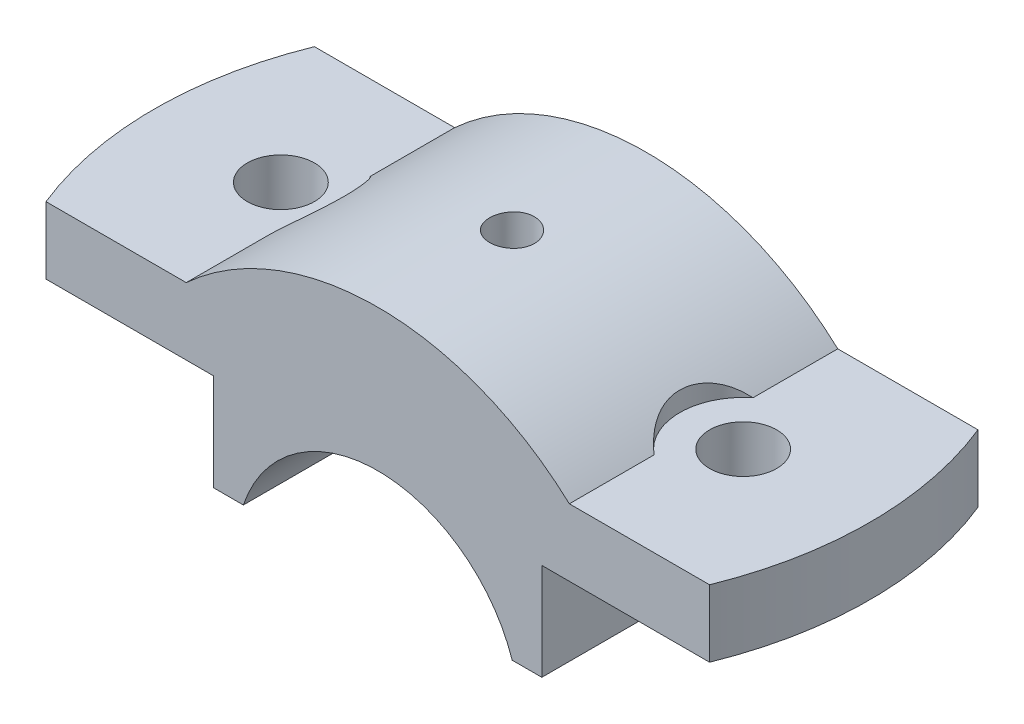
ISO-10303-21;
HEADER;
FILE_DESCRIPTION(('STEP AP214'),'2;1');
FILE_NAME('part.step','',(''),(''),'','','');
FILE_SCHEMA(('AUTOMOTIVE_DESIGN { 1 0 10303 214 1 1 1 1 }'));
ENDSEC;
DATA;
#1=APPLICATION_CONTEXT('core data for automotive mechanical design processes');
#2=APPLICATION_PROTOCOL_DEFINITION('international standard','automotive_design',2000,#1);
#3=PRODUCT_CONTEXT('',#1,'mechanical');
#4=PRODUCT('Part','Part','',(#3));
#5=PRODUCT_RELATED_PRODUCT_CATEGORY('part','',(#4));
#6=PRODUCT_DEFINITION_FORMATION('','',#4);
#7=PRODUCT_DEFINITION_CONTEXT('part definition',#1,'design');
#8=PRODUCT_DEFINITION('design','',#6,#7);
#9=PRODUCT_DEFINITION_SHAPE('','',#8);
#10=(LENGTH_UNIT() NAMED_UNIT(*) SI_UNIT(.MILLI.,.METRE.));
#11=(NAMED_UNIT(*) PLANE_ANGLE_UNIT() SI_UNIT($,.RADIAN.));
#12=(NAMED_UNIT(*) SI_UNIT($,.STERADIAN.) SOLID_ANGLE_UNIT());
#13=UNCERTAINTY_MEASURE_WITH_UNIT(LENGTH_MEASURE(1.E-05),#10,'distance_accuracy_value','');
#14=(GEOMETRIC_REPRESENTATION_CONTEXT(3) GLOBAL_UNCERTAINTY_ASSIGNED_CONTEXT((#13)) GLOBAL_UNIT_ASSIGNED_CONTEXT((#10,
#11,#12)) REPRESENTATION_CONTEXT('',''));
#15=CARTESIAN_POINT('',(0.,0.,0.));
#16=DIRECTION('',(0.,0.,1.));
#17=DIRECTION('',(1.,0.,0.));
#18=AXIS2_PLACEMENT_3D('',#15,#16,#17);
#19=CARTESIAN_POINT('',(0.,0.,18.));
#20=DIRECTION('',(0.,0.,-1.));
#21=DIRECTION('',(-1.,0.,0.));
#22=AXIS2_PLACEMENT_3D('',#19,#20,#21);
#23=CYLINDRICAL_SURFACE('',#22,38.);
#24=CARTESIAN_POINT('',(0.,38.,2.99999999999999));
#25=CARTESIAN_POINT('',(-0.168230277437706,37.9999984430739,2.99999263868346));
#26=CARTESIAN_POINT('',(-0.336575845655095,37.9988709200709,2.98580169916932));
#27=CARTESIAN_POINT('',(-0.668611397196742,37.9944814128081,2.92939894930333));
#28=CARTESIAN_POINT('',(-0.832295850092009,37.9912169949172,2.88715518982943));
#29=CARTESIAN_POINT('',(-1.15015205512757,37.9829226863334,2.77587406357067));
#30=CARTESIAN_POINT('',(-1.3043290493551,37.9778937789402,2.70685161752221));
#31=CARTESIAN_POINT('',(-1.59887136159142,37.9666348413683,2.54399853963546));
#32=CARTESIAN_POINT('',(-1.73923967362019,37.9604050724332,2.45017330191646));
#33=CARTESIAN_POINT('',(-2.00254103126273,37.9474277075509,2.24014409327318));
#34=CARTESIAN_POINT('',(-2.12543792166292,37.9406790810774,2.1238948563935));
#35=CARTESIAN_POINT('',(-2.34999780988339,37.9274332919605,1.87241281605956));
#36=CARTESIAN_POINT('',(-2.45165988585507,37.9209361402441,1.73717918887838));
#37=CARTESIAN_POINT('',(-2.63098484586302,37.9089176287414,1.45135065682847));
#38=CARTESIAN_POINT('',(-2.708616254697,37.903397552738,1.30073594623714));
#39=CARTESIAN_POINT('',(-2.83747510230931,37.8939696224708,0.988558849059875));
#40=CARTESIAN_POINT('',(-2.88870296451239,37.8900617423529,0.82699663808231));
#41=CARTESIAN_POINT('',(-2.96319644645853,37.8843090780475,0.497870679819641));
#42=CARTESIAN_POINT('',(-2.98652059882487,37.8824599758018,0.33032025735777));
#43=CARTESIAN_POINT('',(-3.00472536931325,37.8810204867557,-0.00632681714998046));
#44=CARTESIAN_POINT('',(-2.99960647157769,37.8814300615093,-0.175423442828303));
#45=CARTESIAN_POINT('',(-2.96111886260011,37.8844577346025,-0.509962310035282));
#46=CARTESIAN_POINT('',(-2.92781369865023,37.8870708648728,-0.675411913710737));
#47=CARTESIAN_POINT('',(-2.83399765916122,37.8942034046858,-0.998365215123264));
#48=CARTESIAN_POINT('',(-2.77348654183749,37.8987228311701,-1.15586884222906));
#49=CARTESIAN_POINT('',(-2.62690490032727,37.9091644380148,-1.45866214971911));
#50=CARTESIAN_POINT('',(-2.54080579129679,37.9150881856644,-1.60393793599879));
#51=CARTESIAN_POINT('',(-2.34551283184452,37.9276694800349,-1.87799978791044));
#52=CARTESIAN_POINT('',(-2.23631856235736,37.9343270400699,-2.0067855542603));
#53=CARTESIAN_POINT('',(-1.99757813910437,37.947647885739,-2.24458115896057));
#54=CARTESIAN_POINT('',(-1.86797703439473,37.9543111370687,-2.35353583758633));
#55=CARTESIAN_POINT('',(-1.59229376436976,37.9668751419437,-2.54815019879117));
#56=CARTESIAN_POINT('',(-1.44621158946688,37.9727758950454,-2.63380986781872));
#57=CARTESIAN_POINT('',(-1.14167761997913,37.983150993084,-2.77939892547026));
#58=CARTESIAN_POINT('',(-0.983224692335488,37.9876252071703,-2.83932595392175));
#59=CARTESIAN_POINT('',(-0.658463212690177,37.9946415451888,-2.93171041942903));
#60=CARTESIAN_POINT('',(-0.492154807064346,37.997183705107,-2.96416836811962));
#61=CARTESIAN_POINT('',(-0.156881478742684,38.0000448768352,-3.00062434440681));
#62=CARTESIAN_POINT('',(0.0120751089608382,38.0003698415183,-3.00469857910482));
#63=CARTESIAN_POINT('',(0.348269003373999,37.9987758913175,-2.98447098943402));
#64=CARTESIAN_POINT('',(0.515506324442483,37.9968569951891,-2.96016940224688));
#65=CARTESIAN_POINT('',(0.843297753735754,37.9909950041868,-2.88394314979588));
#66=CARTESIAN_POINT('',(1.00386010671882,37.987054491835,-2.83205372367032));
#67=CARTESIAN_POINT('',(1.31399900365978,37.9775920824189,-2.70216068710782));
#68=CARTESIAN_POINT('',(1.46357539119334,37.9720701628431,-2.62415670492505));
#69=CARTESIAN_POINT('',(1.74784375041781,37.9600494395666,-2.44405671040129));
#70=CARTESIAN_POINT('',(1.88250358772923,37.953548595394,-2.34191011569745));
#71=CARTESIAN_POINT('',(2.13279217984117,37.9403075453845,-2.11649766051109));
#72=CARTESIAN_POINT('',(2.24842063776818,37.9335673358158,-1.99323147064187));
#73=CARTESIAN_POINT('',(2.4576248497514,37.9205896766453,-1.72874864835165));
#74=CARTESIAN_POINT('',(2.55115094155127,37.9143533795852,-1.58749266904679));
#75=CARTESIAN_POINT('',(2.713155238272,37.9031055627809,-1.29123629441747));
#76=CARTESIAN_POINT('',(2.78163367119924,37.8980940318878,-1.13623602422189));
#77=CARTESIAN_POINT('',(2.89151387110069,37.8898693720601,-0.817068099787168));
#78=CARTESIAN_POINT('',(2.93294623887224,37.8866542112497,-0.652911034998946));
#79=CARTESIAN_POINT('',(2.98765790023766,37.8823793491511,-0.319943850373173));
#80=CARTESIAN_POINT('',(3.00093767292138,37.8813196111828,-0.151133809767669));
#81=CARTESIAN_POINT('',(2.99896188688675,37.8814760426207,0.185853858942923));
#82=CARTESIAN_POINT('',(2.98378436644711,37.8826859878913,0.354031953001599));
#83=CARTESIAN_POINT('',(2.92548733876923,37.887232237977,0.68544287301911));
#84=CARTESIAN_POINT('',(2.8823677867555,37.8905685461995,0.848675691052988));
#85=CARTESIAN_POINT('',(2.7694300101543,37.8989899804525,1.16556899687011));
#86=CARTESIAN_POINT('',(2.69961296444521,37.9040750292632,1.31922990697071));
#87=CARTESIAN_POINT('',(2.535271096382,37.9154210711218,1.61266178094886));
#88=CARTESIAN_POINT('',(2.44074672054794,37.9216820429175,1.75243299578316));
#89=CARTESIAN_POINT('',(2.22938062382269,37.9346948182221,2.01451680288399));
#90=CARTESIAN_POINT('',(2.11248130954251,37.941447859921,2.13678288515432));
#91=CARTESIAN_POINT('',(1.85978424897896,37.954672635902,2.36000556130416));
#92=CARTESIAN_POINT('',(1.72398192526551,37.9611443015481,2.46095697881558));
#93=CARTESIAN_POINT('',(1.43709756450133,37.9730876131211,2.63880542567551));
#94=CARTESIAN_POINT('',(1.2859897583193,37.978557527474,2.71566096437293));
#95=CARTESIAN_POINT('',(0.973076064569826,37.9878601967286,2.8428120018995));
#96=CARTESIAN_POINT('',(0.811282773093927,37.9916948408735,2.89313816633252));
#97=CARTESIAN_POINT('',(0.540438770546244,37.9963056825779,2.95292296572033));
#98=CARTESIAN_POINT('',(0.433132098217289,37.9976847801056,2.97055353917027));
#99=CARTESIAN_POINT('',(0.217232975456251,37.9995324404705,2.99409441950641));
#100=CARTESIAN_POINT('',(0.108640528034263,38.0000010054389,3.0000047538251));
#101=CARTESIAN_POINT('',(0.,38.,2.99999999999999));
#102=B_SPLINE_CURVE_WITH_KNOTS('',3,(#24,#25,#26,#27,#28,#29,#30,#31,#32,#33,#34,#35,#36,#37,
#38,#39,#40,#41,#42,#43,#44,#45,#46,#47,#48,#49,#50,#51,#52,#53,#54,#55,#56,#57,#58,#59,#60,#61,
#62,#63,#64,#65,#66,#67,#68,#69,#70,#71,#72,#73,#74,#75,#76,#77,#78,#79,#80,#81,#82,#83,#84,#85,
#86,#87,#88,#89,#90,#91,#92,#93,#94,#95,#96,#97,#98,#99,#100,#101),.UNSPECIFIED.,.T.,.F.,(4,2,2,
2,2,2,2,2,2,2,2,2,2,2,2,2,2,2,2,2,2,2,2,2,2,2,2,2,2,2,2,2,2,2,2,2,2,2,4),(0.,0.504294188546741,
1.00916370078726,1.51375230936014,2.01823126998903,2.52373945491489,3.02926958047039,
3.53545907123702,4.04164044416132,4.54675814609821,5.05186725021795,5.55584058602808,
6.05981840083593,6.56436134901272,7.06891345298728,7.57484819748388,8.08078323629979,
8.58676466907349,9.09273667730811,9.5973496818578,10.1019584685879,10.6059242398502,
11.1098971854695,11.6149355386039,12.1199817691652,12.6261522324058,13.1323180879118,
13.6379102536977,14.1434938154447,14.6476929456065,15.1518928837201,15.6560705605014,
16.1602391262259,16.6657233184336,17.1713301290485,17.6778028214877,18.183688785524,
18.5093549854356,18.8350204230892),.UNSPECIFIED.);
#103=CARTESIAN_POINT('',(0.,38.,2.99999999999999));
#104=VERTEX_POINT('',#103);
#105=EDGE_CURVE('E11',#104,#104,#102,.T.);
#106=ORIENTED_EDGE('',*,*,#105,.T.);
#107=EDGE_LOOP('',(#106));
#108=FACE_BOUND('',#107,.T.);
#109=CARTESIAN_POINT('',(25.6904651573303,28.,-6.63768331230681));
#110=CARTESIAN_POINT('',(25.5360851043424,28.1416681018721,-6.51420867249738));
#111=CARTESIAN_POINT('',(25.3836215551735,28.2791823336498,-6.38340380017069));
#112=CARTESIAN_POINT('',(25.0841053598261,28.5451833866574,-6.10685950724572));
#113=CARTESIAN_POINT('',(24.9370580895264,28.6736613482156,-5.96110576476095));
#114=CARTESIAN_POINT('',(24.6491941230388,28.9215085426633,-5.65349144226202));
#115=CARTESIAN_POINT('',(24.508431723833,29.0408031542341,-5.49151942353941));
#116=CARTESIAN_POINT('',(24.2363075607749,29.2682904084011,-5.15263687836671));
#117=CARTESIAN_POINT('',(24.1049430857226,29.3764862568107,-4.97573069263073));
#118=CARTESIAN_POINT('',(23.8528205053459,29.5815743674557,-4.60631493821574));
#119=CARTESIAN_POINT('',(23.7321338833277,29.6783916917415,-4.41371469093336));
#120=CARTESIAN_POINT('',(23.5043908446779,29.85908164754,-4.01479632179466));
#121=CARTESIAN_POINT('',(23.3973358972541,29.942952883943,-3.80847672492271));
#122=CARTESIAN_POINT('',(23.1992536300817,30.0966827286364,-3.38422419101506));
#123=CARTESIAN_POINT('',(23.1081729651954,30.1665880882949,-3.16633319991272));
#124=CARTESIAN_POINT('',(22.9434688496595,30.2920447623401,-2.72008092153076));
#125=CARTESIAN_POINT('',(22.869842066784,30.347598816803,-2.49172164276595));
#126=CARTESIAN_POINT('',(22.7499342032063,30.4375648556656,-2.05682098381958));
#127=CARTESIAN_POINT('',(22.7013462567531,30.4737833576563,-1.85128534823193));
#128=CARTESIAN_POINT('',(22.6194172898017,30.534645499234,-1.43551725204117));
#129=CARTESIAN_POINT('',(22.5860747992536,30.5592902548309,-1.22528524633892));
#130=CARTESIAN_POINT('',(22.5352129551669,30.5968164834569,-0.801799591498546));
#131=CARTESIAN_POINT('',(22.5176992505084,30.6096937569973,-0.58854489119394));
#132=CARTESIAN_POINT('',(22.4988301660851,30.6235658271181,-0.160939560666252));
#133=CARTESIAN_POINT('',(22.4974739036633,30.624561272785,0.0534110090511161));
#134=CARTESIAN_POINT('',(22.5103301119086,30.6151119876344,0.461997479818133));
#135=CARTESIAN_POINT('',(22.5231488228924,30.6056914251709,0.656303160135759));
#136=CARTESIAN_POINT('',(22.5619809221014,30.5770763766543,1.04286259298839));
#137=CARTESIAN_POINT('',(22.5879939672906,30.5578821447042,1.23511639873687));
#138=CARTESIAN_POINT('',(22.6528192304938,30.5098574663833,1.61613906729808));
#139=CARTESIAN_POINT('',(22.6916259266854,30.4810311771979,1.80490939654947));
#140=CARTESIAN_POINT('',(22.7814851533843,30.4139289484325,2.17779604427592));
#141=CARTESIAN_POINT('',(22.8325379785097,30.3756527815061,2.36191225066401));
#142=CARTESIAN_POINT('',(22.9463727274414,30.2897519777021,2.72495933677601));
#143=CARTESIAN_POINT('',(23.0091940590921,30.2420959034169,2.90387039063445));
#144=CARTESIAN_POINT('',(23.1456283742011,30.1378044455699,3.25489148863348));
#145=CARTESIAN_POINT('',(23.2192449894415,30.0811660396201,3.42699921914348));
#146=CARTESIAN_POINT('',(23.3763137314078,29.9592695660633,3.76349373210635));
#147=CARTESIAN_POINT('',(23.4597660818508,29.8940113023904,3.92788033882065));
#148=CARTESIAN_POINT('',(23.6355270453779,29.7552415450916,4.24828704232641));
#149=CARTESIAN_POINT('',(23.7278387953854,29.6817271265587,4.40430414494654));
#150=CARTESIAN_POINT('',(23.9282386479047,29.5204551498758,4.7199551083489));
#151=CARTESIAN_POINT('',(24.0370002176616,29.4320220049331,4.87881602386905));
#152=CARTESIAN_POINT('',(24.2623844714665,29.2465042091278,5.1856332961988));
#153=CARTESIAN_POINT('',(24.379010630913,29.1494157272481,5.33358477081362));
#154=CARTESIAN_POINT('',(24.6187042069683,28.9472618083659,5.61815393006346));
#155=CARTESIAN_POINT('',(24.7417672458198,28.8422017715012,5.75477915839726));
#156=CARTESIAN_POINT('',(24.9931857635631,28.6246099475779,6.01673825944899));
#157=CARTESIAN_POINT('',(25.121541230047,28.5120781780363,6.14207215863704));
#158=CARTESIAN_POINT('',(25.3239635142993,28.3320696328102,6.32788833390874));
#159=CARTESIAN_POINT('',(25.3966039536003,28.2669811541268,6.39227987552886));
#160=CARTESIAN_POINT('',(25.5428336292653,28.1349133065772,6.51755974656751));
#161=CARTESIAN_POINT('',(25.6164208573994,28.0679376662269,6.57845434819236));
#162=CARTESIAN_POINT('',(25.6904651573302,28.0000000000002,6.63768331230707));
#163=B_SPLINE_CURVE_WITH_KNOTS('',3,(#109,#110,#111,#112,#113,#114,#115,#116,#117,#118,#119,
#120,#121,#122,#123,#124,#125,#126,#127,#128,#129,#130,#131,#132,#133,#134,#135,#136,#137,#138,
#139,#140,#141,#142,#143,#144,#145,#146,#147,#148,#149,#150,#151,#152,#153,#154,#155,#156,#157,
#158,#159,#160,#161,#162),.UNSPECIFIED.,.F.,.F.,(4,2,2,2,2,2,2,2,2,2,2,2,2,2,2,2,2,2,2,2,2,2,2,
2,2,2,4),(0.,0.729592400834072,1.45989044138352,2.19560470883999,2.93110586753776,
3.67120763552799,4.41138910352643,5.14904966030398,5.88656927223681,6.52855006409986,
7.1704689396149,7.81261680885222,8.45472959834447,9.03890309081734,9.62306139629815,
10.2069679046447,10.7908884620571,11.3768004587137,11.9629100238154,12.549032922753,
13.1353641263273,13.7703169673958,14.4055522594533,15.040361004022,15.6751682603777,
16.0257258218314,16.3756336015194),.UNSPECIFIED.);
#164=CARTESIAN_POINT('',(25.6904651573303,28.,-6.63768331230681));
#165=VERTEX_POINT('',#164);
#166=CARTESIAN_POINT('',(25.6904651573303,28.,6.63768331230681));
#167=VERTEX_POINT('',#166);
#168=EDGE_CURVE('E140',#165,#167,#163,.T.);
#169=ORIENTED_EDGE('',*,*,#168,.F.);
#170=DIRECTION('',(0.,0.,-1.));
#171=VECTOR('',#170,1.);
#172=CARTESIAN_POINT('',(25.6904651573303,28.,18.));
#173=LINE('',#172,#171);
#174=CARTESIAN_POINT('',(25.6904651573303,28.,-18.));
#175=VERTEX_POINT('',#174);
#176=EDGE_CURVE('E145',#165,#175,#173,.T.);
#177=ORIENTED_EDGE('',*,*,#176,.T.);
#178=CARTESIAN_POINT('',(0.,0.,-18.));
#179=DIRECTION('',(0.,0.,1.));
#180=DIRECTION('',(1.,0.,0.));
#181=AXIS2_PLACEMENT_3D('',#178,#179,#180);
#182=CIRCLE('',#181,38.);
#183=CARTESIAN_POINT('',(-25.6904651573303,28.,-18.));
#184=VERTEX_POINT('',#183);
#185=EDGE_CURVE('E311',#175,#184,#182,.T.);
#186=ORIENTED_EDGE('',*,*,#185,.T.);
#187=DIRECTION('',(0.,0.,-1.));
#188=VECTOR('',#187,1.);
#189=CARTESIAN_POINT('',(-25.6904651573303,28.,18.));
#190=LINE('',#189,#188);
#191=CARTESIAN_POINT('',(-25.6904651573303,28.,-6.6376833123068));
#192=VERTEX_POINT('',#191);
#193=EDGE_CURVE('E161',#192,#184,#190,.T.);
#194=ORIENTED_EDGE('',*,*,#193,.F.);
#195=CARTESIAN_POINT('',(-25.6904651573303,28.,6.6376833123068));
#196=CARTESIAN_POINT('',(-25.5360851043424,28.1416681018721,6.51420867249738));
#197=CARTESIAN_POINT('',(-25.3836215551735,28.2791823336498,6.38340380017069));
#198=CARTESIAN_POINT('',(-25.0841053598261,28.5451833866574,6.10685950724571));
#199=CARTESIAN_POINT('',(-24.9370580895264,28.6736613482156,5.96110576476094));
#200=CARTESIAN_POINT('',(-24.6491941230388,28.9215085426632,5.65349144226201));
#201=CARTESIAN_POINT('',(-24.508431723833,29.0408031542341,5.4915194235394));
#202=CARTESIAN_POINT('',(-24.2363075607749,29.2682904084011,5.1526368783667));
#203=CARTESIAN_POINT('',(-24.1049430857226,29.3764862568107,4.97573069263072));
#204=CARTESIAN_POINT('',(-23.8528205053459,29.5815743674557,4.60631493821573));
#205=CARTESIAN_POINT('',(-23.7321338833277,29.6783916917415,4.41371469093335));
#206=CARTESIAN_POINT('',(-23.5043908446779,29.85908164754,4.01479632179465));
#207=CARTESIAN_POINT('',(-23.3973358972541,29.942952883943,3.8084767249227));
#208=CARTESIAN_POINT('',(-23.1992536300817,30.0966827286364,3.38422419101505));
#209=CARTESIAN_POINT('',(-23.1081729651954,30.1665880882949,3.16633319991271));
#210=CARTESIAN_POINT('',(-22.9434688496595,30.2920447623401,2.72008092153075));
#211=CARTESIAN_POINT('',(-22.869842066784,30.347598816803,2.49172164276594));
#212=CARTESIAN_POINT('',(-22.7499342032063,30.4375648556656,2.05682098381957));
#213=CARTESIAN_POINT('',(-22.7013462567531,30.4737833576563,1.85128534823192));
#214=CARTESIAN_POINT('',(-22.6194172898017,30.534645499234,1.43551725204116));
#215=CARTESIAN_POINT('',(-22.5860747992536,30.5592902548309,1.22528524633891));
#216=CARTESIAN_POINT('',(-22.5352129551669,30.5968164834569,0.801799591498536));
#217=CARTESIAN_POINT('',(-22.5176992505084,30.6096937569973,0.58854489119393));
#218=CARTESIAN_POINT('',(-22.4988301660851,30.6235658271181,0.160939560666243));
#219=CARTESIAN_POINT('',(-22.4974739036633,30.624561272785,-0.053411009051124));
#220=CARTESIAN_POINT('',(-22.5103301119086,30.6151119876343,-0.461997479818141));
#221=CARTESIAN_POINT('',(-22.5231488228924,30.6056914251709,-0.656303160135767));
#222=CARTESIAN_POINT('',(-22.5619809221014,30.5770763766543,-1.0428625929884));
#223=CARTESIAN_POINT('',(-22.5879939672906,30.5578821447042,-1.23511639873688));
#224=CARTESIAN_POINT('',(-22.6528192304938,30.5098574663833,-1.61613906729809));
#225=CARTESIAN_POINT('',(-22.6916259266854,30.4810311771979,-1.80490939654948));
#226=CARTESIAN_POINT('',(-22.7814851533843,30.4139289484325,-2.17779604427593));
#227=CARTESIAN_POINT('',(-22.8325379785097,30.3756527815061,-2.36191225066402));
#228=CARTESIAN_POINT('',(-22.9463727274414,30.2897519777021,-2.72495933677602));
#229=CARTESIAN_POINT('',(-23.0091940590921,30.2420959034169,-2.90387039063446));
#230=CARTESIAN_POINT('',(-23.1456283742011,30.1378044455699,-3.25489148863349));
#231=CARTESIAN_POINT('',(-23.2192449894415,30.0811660396201,-3.42699921914349));
#232=CARTESIAN_POINT('',(-23.3763137314078,29.9592695660632,-3.76349373210636));
#233=CARTESIAN_POINT('',(-23.4597660818508,29.8940113023904,-3.92788033882065));
#234=CARTESIAN_POINT('',(-23.6355270453779,29.7552415450916,-4.24828704232642));
#235=CARTESIAN_POINT('',(-23.7278387953854,29.6817271265587,-4.40430414494655));
#236=CARTESIAN_POINT('',(-23.9282386479047,29.5204551498758,-4.71995510834891));
#237=CARTESIAN_POINT('',(-24.0370002176616,29.432022004933,-4.87881602386905));
#238=CARTESIAN_POINT('',(-24.2623844714665,29.2465042091278,-5.1856332961988));
#239=CARTESIAN_POINT('',(-24.379010630913,29.1494157272481,-5.33358477081362));
#240=CARTESIAN_POINT('',(-24.6187042069683,28.9472618083659,-5.61815393006346));
#241=CARTESIAN_POINT('',(-24.7417672458198,28.8422017715012,-5.75477915839727));
#242=CARTESIAN_POINT('',(-24.9931857635632,28.6246099475779,-6.016738259449));
#243=CARTESIAN_POINT('',(-25.121541230047,28.5120781780363,-6.14207215863704));
#244=CARTESIAN_POINT('',(-25.3239635142993,28.3320696328102,-6.32788833390874));
#245=CARTESIAN_POINT('',(-25.3966039536003,28.2669811541268,-6.39227987552886));
#246=CARTESIAN_POINT('',(-25.5428336292653,28.1349133065772,-6.51755974656751));
#247=CARTESIAN_POINT('',(-25.6164208573994,28.0679376662269,-6.57845434819236));
#248=CARTESIAN_POINT('',(-25.6904651573302,28.0000000000002,-6.63768331230707));
#249=B_SPLINE_CURVE_WITH_KNOTS('',3,(#195,#196,#197,#198,#199,#200,#201,#202,#203,#204,#205,
#206,#207,#208,#209,#210,#211,#212,#213,#214,#215,#216,#217,#218,#219,#220,#221,#222,#223,#224,
#225,#226,#227,#228,#229,#230,#231,#232,#233,#234,#235,#236,#237,#238,#239,#240,#241,#242,#243,
#244,#245,#246,#247,#248),.UNSPECIFIED.,.F.,.F.,(4,2,2,2,2,2,2,2,2,2,2,2,2,2,2,2,2,2,2,2,2,2,2,
2,2,2,4),(0.,0.729592400834075,1.45989044138352,2.19560470883999,2.93110586753776,
3.67120763552799,4.41138910352644,5.14904966030398,5.88656927223681,6.52855006409986,
7.1704689396149,7.81261680885222,8.45472959834447,9.03890309081734,9.62306139629816,
10.2069679046447,10.7908884620571,11.3768004587137,11.9629100238154,12.549032922753,
13.1353641263273,13.7703169673958,14.4055522594533,15.040361004022,15.6751682603777,
16.0257258218314,16.3756336015194),.UNSPECIFIED.);
#250=CARTESIAN_POINT('',(-25.6904651573303,28.,6.6376833123068));
#251=VERTEX_POINT('',#250);
#252=EDGE_CURVE('E223',#251,#192,#249,.T.);
#253=ORIENTED_EDGE('',*,*,#252,.F.);
#254=CARTESIAN_POINT('',(-25.6904651573303,28.,18.));
#255=VERTEX_POINT('',#254);
#256=EDGE_CURVE('E157',#255,#251,#190,.T.);
#257=ORIENTED_EDGE('',*,*,#256,.F.);
#258=CARTESIAN_POINT('',(0.,0.,18.));
#259=DIRECTION('',(0.,0.,1.));
#260=DIRECTION('',(1.,0.,0.));
#261=AXIS2_PLACEMENT_3D('',#258,#259,#260);
#262=CIRCLE('',#261,38.);
#263=CARTESIAN_POINT('',(25.6904651573303,28.,18.));
#264=VERTEX_POINT('',#263);
#265=EDGE_CURVE('E356',#264,#255,#262,.T.);
#266=ORIENTED_EDGE('',*,*,#265,.F.);
#267=EDGE_CURVE('E148',#264,#167,#173,.T.);
#268=ORIENTED_EDGE('',*,*,#267,.T.);
#269=EDGE_LOOP('',(#169,#177,#186,#194,#253,#257,#266,#268));
#270=FACE_BOUND('',#269,.T.);
#271=ADVANCED_FACE('F33',(#108,#270),#23,.T.);
#272=CARTESIAN_POINT('',(22.,6.,18.));
#273=DIRECTION('',(-1.,0.,0.));
#274=DIRECTION('',(0.,-1.,0.));
#275=AXIS2_PLACEMENT_3D('',#272,#273,#274);
#276=PLANE('',#275);
#277=DIRECTION('',(0.,1.,0.));
#278=VECTOR('',#277,1.);
#279=CARTESIAN_POINT('',(22.,6.,-18.));
#280=LINE('',#279,#278);
#281=CARTESIAN_POINT('',(22.,6.,-18.));
#282=VERTEX_POINT('',#281);
#283=CARTESIAN_POINT('',(22.,19.,-18.));
#284=VERTEX_POINT('',#283);
#285=EDGE_CURVE('E171',#282,#284,#280,.T.);
#286=ORIENTED_EDGE('',*,*,#285,.T.);
#287=DIRECTION('',(0.,0.,-1.));
#288=VECTOR('',#287,1.);
#289=CARTESIAN_POINT('',(22.,19.,18.));
#290=LINE('',#289,#288);
#291=CARTESIAN_POINT('',(22.,19.,18.));
#292=VERTEX_POINT('',#291);
#293=EDGE_CURVE('E159',#292,#284,#290,.T.);
#294=ORIENTED_EDGE('',*,*,#293,.F.);
#295=DIRECTION('',(0.,1.,0.));
#296=VECTOR('',#295,1.);
#297=CARTESIAN_POINT('',(22.,6.,18.));
#298=LINE('',#297,#296);
#299=CARTESIAN_POINT('',(22.,6.,18.));
#300=VERTEX_POINT('',#299);
#301=EDGE_CURVE('E325',#300,#292,#298,.T.);
#302=ORIENTED_EDGE('',*,*,#301,.F.);
#303=DIRECTION('',(0.,0.,-1.));
#304=VECTOR('',#303,1.);
#305=CARTESIAN_POINT('',(22.,6.,18.));
#306=LINE('',#305,#304);
#307=EDGE_CURVE('E300',#300,#282,#306,.T.);
#308=ORIENTED_EDGE('',*,*,#307,.T.);
#309=EDGE_LOOP('',(#286,#294,#302,#308));
#310=FACE_BOUND('',#309,.T.);
#311=ADVANCED_FACE('F35',(#310),#276,.F.);
#312=CARTESIAN_POINT('',(22.,19.,18.));
#313=DIRECTION('',(0.,1.,0.));
#314=DIRECTION('',(-1.,0.,0.));
#315=AXIS2_PLACEMENT_3D('',#312,#313,#314);
#316=PLANE('',#315);
#317=CARTESIAN_POINT('',(31.,19.,0.));
#318=DIRECTION('',(0.,1.,0.));
#319=DIRECTION('',(-1.,0.,0.));
#320=AXIS2_PLACEMENT_3D('',#317,#318,#319);
#321=CIRCLE('',#320,4.5);
#322=CARTESIAN_POINT('',(26.5,19.,0.));
#323=VERTEX_POINT('',#322);
#324=EDGE_CURVE('E511',#323,#323,#321,.T.);
#325=ORIENTED_EDGE('',*,*,#324,.T.);
#326=EDGE_LOOP('',(#325));
#327=FACE_BOUND('',#326,.T.);
#328=DIRECTION('',(1.,0.,0.));
#329=VECTOR('',#328,1.);
#330=CARTESIAN_POINT('',(22.,19.,-18.));
#331=LINE('',#330,#329);
#332=CARTESIAN_POINT('',(44.497190922574,19.,-18.));
#333=VERTEX_POINT('',#332);
#334=EDGE_CURVE('E302',#284,#333,#331,.T.);
#335=ORIENTED_EDGE('',*,*,#334,.T.);
#336=CARTESIAN_POINT('',(0.,19.,0.));
#337=DIRECTION('',(0.,1.,0.));
#338=DIRECTION('',(-1.,0.,0.));
#339=AXIS2_PLACEMENT_3D('',#336,#337,#338);
#340=CIRCLE('',#339,48.);
#341=CARTESIAN_POINT('',(44.497190922574,19.,18.));
#342=VERTEX_POINT('',#341);
#343=EDGE_CURVE('E61',#333,#342,#340,.F.);
#344=ORIENTED_EDGE('',*,*,#343,.T.);
#345=DIRECTION('',(1.,0.,0.));
#346=VECTOR('',#345,1.);
#347=CARTESIAN_POINT('',(22.,19.,18.));
#348=LINE('',#347,#346);
#349=EDGE_CURVE('E366',#292,#342,#348,.T.);
#350=ORIENTED_EDGE('',*,*,#349,.F.);
#351=ORIENTED_EDGE('',*,*,#293,.T.);
#352=EDGE_LOOP('',(#335,#344,#350,#351));
#353=FACE_BOUND('',#352,.T.);
#354=ADVANCED_FACE('F279',(#327,#353),#316,.F.);
#355=CARTESIAN_POINT('',(50.,28.,18.));
#356=DIRECTION('',(0.,-1.,0.));
#357=DIRECTION('',(1.,0.,0.));
#358=AXIS2_PLACEMENT_3D('',#355,#356,#357);
#359=PLANE('',#358);
#360=ORIENTED_EDGE('',*,*,#176,.F.);
#361=CARTESIAN_POINT('',(31.,28.,0.));
#362=DIRECTION('',(0.,1.,0.));
#363=DIRECTION('',(-1.,0.,0.));
#364=AXIS2_PLACEMENT_3D('',#361,#362,#363);
#365=CIRCLE('',#364,8.5);
#366=EDGE_CURVE('E53',#165,#167,#365,.T.);
#367=ORIENTED_EDGE('',*,*,#366,.T.);
#368=ORIENTED_EDGE('',*,*,#267,.F.);
#369=DIRECTION('',(-1.,0.,0.));
#370=VECTOR('',#369,1.);
#371=CARTESIAN_POINT('',(50.,28.,18.));
#372=LINE('',#371,#370);
#373=CARTESIAN_POINT('',(44.497190922574,28.,18.));
#374=VERTEX_POINT('',#373);
#375=EDGE_CURVE('E368',#374,#264,#372,.T.);
#376=ORIENTED_EDGE('',*,*,#375,.F.);
#377=CARTESIAN_POINT('',(0.,28.,0.));
#378=DIRECTION('',(0.,-1.,0.));
#379=DIRECTION('',(0.,0.,1.));
#380=AXIS2_PLACEMENT_3D('',#377,#378,#379);
#381=CIRCLE('',#380,48.);
#382=CARTESIAN_POINT('',(44.497190922574,28.,-18.));
#383=VERTEX_POINT('',#382);
#384=EDGE_CURVE('E149',#383,#374,#381,.T.);
#385=ORIENTED_EDGE('',*,*,#384,.F.);
#386=DIRECTION('',(-1.,0.,0.));
#387=VECTOR('',#386,1.);
#388=CARTESIAN_POINT('',(50.,28.,-18.));
#389=LINE('',#388,#387);
#390=EDGE_CURVE('E155',#383,#175,#389,.T.);
#391=ORIENTED_EDGE('',*,*,#390,.T.);
#392=EDGE_LOOP('',(#360,#367,#368,#376,#385,#391));
#393=FACE_BOUND('',#392,.T.);
#394=CARTESIAN_POINT('',(31.,28.,0.));
#395=DIRECTION('',(0.,1.,0.));
#396=DIRECTION('',(0.,0.,1.));
#397=AXIS2_PLACEMENT_3D('',#394,#395,#396);
#398=CIRCLE('',#397,4.5);
#399=CARTESIAN_POINT('',(31.,28.,4.5));
#400=VERTEX_POINT('',#399);
#401=EDGE_CURVE('E230',#400,#400,#398,.T.);
#402=ORIENTED_EDGE('',*,*,#401,.F.);
#403=EDGE_LOOP('',(#402));
#404=FACE_BOUND('',#403,.T.);
#405=ADVANCED_FACE('F151',(#393,#404),#359,.F.);
#406=CARTESIAN_POINT('',(-50.,28.,18.));
#407=DIRECTION('',(0.,-1.,0.));
#408=DIRECTION('',(0.,0.,-1.));
#409=AXIS2_PLACEMENT_3D('',#406,#407,#408);
#410=PLANE('',#409);
#411=DIRECTION('',(-1.,0.,0.));
#412=VECTOR('',#411,1.);
#413=CARTESIAN_POINT('',(-50.,28.,-18.));
#414=LINE('',#413,#412);
#415=CARTESIAN_POINT('',(-44.497190922574,28.,-18.));
#416=VERTEX_POINT('',#415);
#417=EDGE_CURVE('E313',#184,#416,#414,.T.);
#418=ORIENTED_EDGE('',*,*,#417,.T.);
#419=CARTESIAN_POINT('',(0.,28.,0.));
#420=DIRECTION('',(0.,-1.,0.));
#421=DIRECTION('',(0.,0.,1.));
#422=AXIS2_PLACEMENT_3D('',#419,#420,#421);
#423=CIRCLE('',#422,48.);
#424=CARTESIAN_POINT('',(-44.497190922574,28.,18.));
#425=VERTEX_POINT('',#424);
#426=EDGE_CURVE('E214',#425,#416,#423,.T.);
#427=ORIENTED_EDGE('',*,*,#426,.F.);
#428=DIRECTION('',(-1.,0.,0.));
#429=VECTOR('',#428,1.);
#430=CARTESIAN_POINT('',(-50.,28.,18.));
#431=LINE('',#430,#429);
#432=EDGE_CURVE('E351',#255,#425,#431,.T.);
#433=ORIENTED_EDGE('',*,*,#432,.F.);
#434=ORIENTED_EDGE('',*,*,#256,.T.);
#435=CARTESIAN_POINT('',(-31.,28.,0.));
#436=DIRECTION('',(0.,1.,0.));
#437=DIRECTION('',(0.,0.,1.));
#438=AXIS2_PLACEMENT_3D('',#435,#436,#437);
#439=CIRCLE('',#438,8.5);
#440=EDGE_CURVE('E221',#251,#192,#439,.T.);
#441=ORIENTED_EDGE('',*,*,#440,.T.);
#442=ORIENTED_EDGE('',*,*,#193,.T.);
#443=EDGE_LOOP('',(#418,#427,#433,#434,#441,#442));
#444=FACE_BOUND('',#443,.T.);
#445=CARTESIAN_POINT('',(-31.,28.,0.));
#446=DIRECTION('',(0.,1.,0.));
#447=DIRECTION('',(0.,0.,1.));
#448=AXIS2_PLACEMENT_3D('',#445,#446,#447);
#449=CIRCLE('',#448,4.5);
#450=CARTESIAN_POINT('',(-31.,28.,4.5));
#451=VERTEX_POINT('',#450);
#452=EDGE_CURVE('E172',#451,#451,#449,.T.);
#453=ORIENTED_EDGE('',*,*,#452,.F.);
#454=EDGE_LOOP('',(#453));
#455=FACE_BOUND('',#454,.T.);
#456=ADVANCED_FACE('F272',(#444,#455),#410,.F.);
#457=CARTESIAN_POINT('',(-22.,19.,18.));
#458=DIRECTION('',(0.,1.,0.));
#459=DIRECTION('',(-1.,0.,0.));
#460=AXIS2_PLACEMENT_3D('',#457,#458,#459);
#461=PLANE('',#460);
#462=CARTESIAN_POINT('',(-31.,19.,0.));
#463=DIRECTION('',(0.,1.,0.));
#464=DIRECTION('',(-1.,0.,0.));
#465=AXIS2_PLACEMENT_3D('',#462,#463,#464);
#466=CIRCLE('',#465,4.5);
#467=CARTESIAN_POINT('',(-35.5,19.,0.));
#468=VERTEX_POINT('',#467);
#469=EDGE_CURVE('E168',#468,#468,#466,.T.);
#470=ORIENTED_EDGE('',*,*,#469,.T.);
#471=EDGE_LOOP('',(#470));
#472=FACE_BOUND('',#471,.T.);
#473=DIRECTION('',(1.,0.,0.));
#474=VECTOR('',#473,1.);
#475=CARTESIAN_POINT('',(-22.,19.,18.));
#476=LINE('',#475,#474);
#477=CARTESIAN_POINT('',(-44.497190922574,19.,18.));
#478=VERTEX_POINT('',#477);
#479=CARTESIAN_POINT('',(-22.,19.,18.));
#480=VERTEX_POINT('',#479);
#481=EDGE_CURVE('E349',#478,#480,#476,.T.);
#482=ORIENTED_EDGE('',*,*,#481,.F.);
#483=CARTESIAN_POINT('',(0.,19.,0.));
#484=DIRECTION('',(0.,1.,0.));
#485=DIRECTION('',(-1.,0.,0.));
#486=AXIS2_PLACEMENT_3D('',#483,#484,#485);
#487=CIRCLE('',#486,48.);
#488=CARTESIAN_POINT('',(-44.497190922574,19.,-18.));
#489=VERTEX_POINT('',#488);
#490=EDGE_CURVE('E218',#478,#489,#487,.F.);
#491=ORIENTED_EDGE('',*,*,#490,.T.);
#492=DIRECTION('',(1.,0.,0.));
#493=VECTOR('',#492,1.);
#494=CARTESIAN_POINT('',(-22.,19.,-18.));
#495=LINE('',#494,#493);
#496=CARTESIAN_POINT('',(-22.,19.,-18.));
#497=VERTEX_POINT('',#496);
#498=EDGE_CURVE('E315',#489,#497,#495,.T.);
#499=ORIENTED_EDGE('',*,*,#498,.T.);
#500=DIRECTION('',(0.,0.,-1.));
#501=VECTOR('',#500,1.);
#502=CARTESIAN_POINT('',(-22.,19.,18.));
#503=LINE('',#502,#501);
#504=EDGE_CURVE('E335',#480,#497,#503,.T.);
#505=ORIENTED_EDGE('',*,*,#504,.F.);
#506=EDGE_LOOP('',(#482,#491,#499,#505));
#507=FACE_BOUND('',#506,.T.);
#508=ADVANCED_FACE('F269',(#472,#507),#461,.F.);
#509=CARTESIAN_POINT('',(-22.,5.99999999999999,18.));
#510=DIRECTION('',(1.,0.,0.));
#511=DIRECTION('',(0.,0.,-1.));
#512=AXIS2_PLACEMENT_3D('',#509,#510,#511);
#513=PLANE('',#512);
#514=DIRECTION('',(0.,-1.,0.));
#515=VECTOR('',#514,1.);
#516=CARTESIAN_POINT('',(-22.,5.99999999999999,-18.));
#517=LINE('',#516,#515);
#518=CARTESIAN_POINT('',(-22.,5.99999999999999,-18.));
#519=VERTEX_POINT('',#518);
#520=EDGE_CURVE('E317',#497,#519,#517,.T.);
#521=ORIENTED_EDGE('',*,*,#520,.T.);
#522=DIRECTION('',(0.,0.,-1.));
#523=VECTOR('',#522,1.);
#524=CARTESIAN_POINT('',(-22.,5.99999999999999,18.));
#525=LINE('',#524,#523);
#526=CARTESIAN_POINT('',(-22.,5.99999999999999,18.));
#527=VERTEX_POINT('',#526);
#528=EDGE_CURVE('E333',#527,#519,#525,.T.);
#529=ORIENTED_EDGE('',*,*,#528,.F.);
#530=DIRECTION('',(0.,-1.,0.));
#531=VECTOR('',#530,1.);
#532=CARTESIAN_POINT('',(-22.,5.99999999999999,18.));
#533=LINE('',#532,#531);
#534=EDGE_CURVE('E350',#480,#527,#533,.T.);
#535=ORIENTED_EDGE('',*,*,#534,.F.);
#536=ORIENTED_EDGE('',*,*,#504,.T.);
#537=EDGE_LOOP('',(#521,#529,#535,#536));
#538=FACE_BOUND('',#537,.T.);
#539=ADVANCED_FACE('F265',(#538),#513,.F.);
#540=CARTESIAN_POINT('',(-22.,5.99999999999999,18.));
#541=DIRECTION('',(0.,1.,0.));
#542=DIRECTION('',(-1.,0.,0.));
#543=AXIS2_PLACEMENT_3D('',#540,#541,#542);
#544=PLANE('',#543);
#545=DIRECTION('',(1.,0.,0.));
#546=VECTOR('',#545,1.);
#547=CARTESIAN_POINT('',(-22.,5.99999999999999,-18.));
#548=LINE('',#547,#546);
#549=CARTESIAN_POINT('',(-18.02775637732,5.99999999999999,-18.));
#550=VERTEX_POINT('',#549);
#551=EDGE_CURVE('E319',#519,#550,#548,.T.);
#552=ORIENTED_EDGE('',*,*,#551,.T.);
#553=DIRECTION('',(0.,0.,-1.));
#554=VECTOR('',#553,1.);
#555=CARTESIAN_POINT('',(-18.02775637732,5.99999999999999,18.));
#556=LINE('',#555,#554);
#557=CARTESIAN_POINT('',(-18.02775637732,5.99999999999999,18.));
#558=VERTEX_POINT('',#557);
#559=EDGE_CURVE('E330',#558,#550,#556,.T.);
#560=ORIENTED_EDGE('',*,*,#559,.F.);
#561=DIRECTION('',(1.,0.,0.));
#562=VECTOR('',#561,1.);
#563=CARTESIAN_POINT('',(-22.,5.99999999999999,18.));
#564=LINE('',#563,#562);
#565=EDGE_CURVE('E353',#527,#558,#564,.T.);
#566=ORIENTED_EDGE('',*,*,#565,.F.);
#567=ORIENTED_EDGE('',*,*,#528,.T.);
#568=EDGE_LOOP('',(#552,#560,#566,#567));
#569=FACE_BOUND('',#568,.T.);
#570=ADVANCED_FACE('F261',(#569),#544,.F.);
#571=CARTESIAN_POINT('',(0.,0.,18.));
#572=DIRECTION('',(0.,0.,-1.));
#573=DIRECTION('',(-1.,0.,0.));
#574=AXIS2_PLACEMENT_3D('',#571,#572,#573);
#575=CYLINDRICAL_SURFACE('',#574,19.);
#576=CARTESIAN_POINT('',(0.,19.,2.49999999999999));
#577=CARTESIAN_POINT('',(0.139778315489381,18.999997967774,2.49999410094607));
#578=CARTESIAN_POINT('',(0.279642447495432,18.9984412683557,2.48823767475851));
#579=CARTESIAN_POINT('',(0.555474474016764,18.9923810422329,2.44152700403634));
#580=CARTESIAN_POINT('',(0.691438217949602,18.9878744896332,2.40654893872552));
#581=CARTESIAN_POINT('',(0.955436642925263,18.9764219373405,2.31444705906101));
#582=CARTESIAN_POINT('',(1.08347675216936,18.9694776299244,2.25733860465933));
#583=CARTESIAN_POINT('',(1.32813277832855,18.9539206812215,2.12263165454414));
#584=CARTESIAN_POINT('',(1.44475055826477,18.9453083126858,2.04503650793576));
#585=CARTESIAN_POINT('',(1.66398308687909,18.9273173646443,1.87105538112386));
#586=CARTESIAN_POINT('',(1.76651843289981,18.9179348817316,1.77456973952705));
#587=CARTESIAN_POINT('',(1.95399133146887,18.8994924119599,1.56576064733009));
#588=CARTESIAN_POINT('',(2.0389279601093,18.890432442053,1.4534363657436));
#589=CARTESIAN_POINT('',(2.18909162338547,18.8736225658863,1.21561789849417));
#590=CARTESIAN_POINT('',(2.254243636291,18.8658776941045,1.09007595594652));
#591=CARTESIAN_POINT('',(2.36250946256607,18.8526269269547,0.82971330966885));
#592=CARTESIAN_POINT('',(2.40562420041089,18.8471209376663,0.694892995440666));
#593=CARTESIAN_POINT('',(2.46834893112872,18.8390089488849,0.420627771177585));
#594=CARTESIAN_POINT('',(2.48809350572304,18.8363863510935,0.281214139706503));
#595=CARTESIAN_POINT('',(2.50393399543624,18.8342874081065,0.00102942145374142));
#596=CARTESIAN_POINT('',(2.50003096100306,18.8348109231579,-0.139741604753912));
#597=CARTESIAN_POINT('',(2.46879737750757,18.8389298660036,-0.417704097944481));
#598=CARTESIAN_POINT('',(2.44161547626707,18.8425058020086,-0.554912597936803));
#599=CARTESIAN_POINT('',(2.36482786882149,18.852296258763,-0.822803762753463));
#600=CARTESIAN_POINT('',(2.31522166359116,18.8585108382319,-0.953486282278279));
#601=CARTESIAN_POINT('',(2.19483509097755,18.8729003199956,-1.20507533515602));
#602=CARTESIAN_POINT('',(2.12399053069557,18.8810811502029,-1.3259507990106));
#603=CARTESIAN_POINT('',(1.96318413435717,18.8984768576706,-1.55415393130079));
#604=CARTESIAN_POINT('',(1.87322133002782,18.9076917872935,-1.66148091311362));
#605=CARTESIAN_POINT('',(1.67591027855668,18.9262039286229,-1.8604029509214));
#606=CARTESIAN_POINT('',(1.5684339827901,18.9355012293485,-1.95187103488117));
#607=CARTESIAN_POINT('',(1.33958658891131,18.9530645440151,-2.11548884034055));
#608=CARTESIAN_POINT('',(1.21821545257772,18.9613305551191,-2.18763850869799));
#609=CARTESIAN_POINT('',(0.964922757293814,18.9759058695861,-2.31057308687671));
#610=CARTESIAN_POINT('',(0.832997072631038,18.9822144030351,-2.36134959301125));
#611=CARTESIAN_POINT('',(0.562390331231887,18.9921571388022,-2.43999334343768));
#612=CARTESIAN_POINT('',(0.423709625549349,18.9957914799384,-2.4678617769038));
#613=CARTESIAN_POINT('',(0.144626841595053,18.9999582136113,-2.49973268466772));
#614=CARTESIAN_POINT('',(0.00424505397900364,19.0005133278906,-2.50390998199236));
#615=CARTESIAN_POINT('',(-0.275216665266613,18.9985205333266,-2.48874205734629));
#616=CARTESIAN_POINT('',(-0.414296627611642,18.9959726978817,-2.46939739177319));
#617=CARTESIAN_POINT('',(-0.686687509149987,18.9880744020358,-2.40787994096775));
#618=CARTESIAN_POINT('',(-0.82001767900448,18.9827342327916,-2.36579096106223));
#619=CARTESIAN_POINT('',(-1.07772769061604,18.9698488481686,-2.26006706877667));
#620=CARTESIAN_POINT('',(-1.20210719868891,18.9623035506347,-2.19643135362992));
#621=CARTESIAN_POINT('',(-1.43916303555311,18.9457917882835,-2.04900056518348));
#622=CARTESIAN_POINT('',(-1.55176881159961,18.9368174879557,-1.96509294211364));
#623=CARTESIAN_POINT('',(-1.76136182953435,18.9184749473973,-1.77965876593364));
#624=CARTESIAN_POINT('',(-1.85834838132062,18.9091066897838,-1.67813143474596));
#625=CARTESIAN_POINT('',(-2.03457405133124,18.8909615049602,-1.45956767417581));
#626=CARTESIAN_POINT('',(-2.11369695379328,18.882188695812,-1.34243714901302));
#627=CARTESIAN_POINT('',(-2.25114524350548,18.8662967388838,-1.0964463235499));
#628=CARTESIAN_POINT('',(-2.30947108507653,18.8591775549807,-0.967586279563252));
#629=CARTESIAN_POINT('',(-2.40348340588748,18.8474274353122,-0.702162244798241));
#630=CARTESIAN_POINT('',(-2.43923433050313,18.8427894223098,-0.565621407141436));
#631=CARTESIAN_POINT('',(-2.48728896692711,18.8365068588229,-0.288409154438023));
#632=CARTESIAN_POINT('',(-2.49959389747028,18.834862152745,-0.147737954475761));
#633=CARTESIAN_POINT('',(-2.50038325713136,18.8347572836292,0.132585217903332));
#634=CARTESIAN_POINT('',(-2.48905029281034,18.8362727080524,0.27223670194302));
#635=CARTESIAN_POINT('',(-2.44327339157393,18.8422647251658,0.547631014500265));
#636=CARTESIAN_POINT('',(-2.40882946081797,18.8467413170668,0.683373844059529));
#637=CARTESIAN_POINT('',(-2.31786734754336,18.8581434764999,0.947066981095643));
#638=CARTESIAN_POINT('',(-2.26135895042261,18.8650679582855,1.0750207139318));
#639=CARTESIAN_POINT('',(-2.12788991460023,18.8805873470397,1.3196597242388));
#640=CARTESIAN_POINT('',(-2.05092891076783,18.8891822838294,1.4363448004849));
#641=CARTESIAN_POINT('',(-1.87806508524071,18.9071536004537,1.65606643442981));
#642=CARTESIAN_POINT('',(-1.78202633147283,18.916535291463,1.75899562327552));
#643=CARTESIAN_POINT('',(-1.57401834863999,18.9349767535594,1.94734544374448));
#644=CARTESIAN_POINT('',(-1.46204538383397,18.9440364485309,2.03276195806478));
#645=CARTESIAN_POINT('',(-1.22480279057949,18.9608556769231,2.1839722390681));
#646=CARTESIAN_POINT('',(-1.09947920166897,18.9686095798624,2.24968193582438));
#647=CARTESIAN_POINT('',(-0.83954097304368,18.9818871351467,2.35902730105119));
#648=CARTESIAN_POINT('',(-0.704936491101719,18.9874131818538,2.40268668066817));
#649=CARTESIAN_POINT('',(-0.474714442967835,18.9942975150946,2.45637452622467));
#650=CARTESIAN_POINT('',(-0.380541684686488,18.9964253917168,2.47271020697246));
#651=CARTESIAN_POINT('',(-0.190925958585041,18.9992773223142,2.49452491255805));
#652=CARTESIAN_POINT('',(-0.0954830015668618,19.0000013882199,2.50000402966206));
#653=CARTESIAN_POINT('',(0.,19.,2.49999999999999));
#654=B_SPLINE_CURVE_WITH_KNOTS('',3,(#576,#577,#578,#579,#580,#581,#582,#583,#584,#585,#586,
#587,#588,#589,#590,#591,#592,#593,#594,#595,#596,#597,#598,#599,#600,#601,#602,#603,#604,#605,
#606,#607,#608,#609,#610,#611,#612,#613,#614,#615,#616,#617,#618,#619,#620,#621,#622,#623,#624,
#625,#626,#627,#628,#629,#630,#631,#632,#633,#634,#635,#636,#637,#638,#639,#640,#641,#642,#643,
#644,#645,#646,#647,#648,#649,#650,#651,#652,#653),.UNSPECIFIED.,.T.,.F.,(4,2,2,2,2,2,2,2,2,2,2,
2,2,2,2,2,2,2,2,2,2,2,2,2,2,2,2,2,2,2,2,2,2,2,2,2,2,2,4),(0.,0.418986144750715,
0.838402751295032,1.25752877489171,1.67658632335898,2.09791737096997,2.5192705322666,
2.94220203521432,3.36511579450622,3.78558208482052,4.20602969778295,4.62381238038423,
5.04160436068184,5.46067207111285,5.87976101093415,6.30206422391833,6.72436859858556,
7.14683886382432,7.56928719694782,7.98861407741508,8.40793103915518,8.82571338706287,
9.24351130200043,9.66368440831748,10.0838760739927,10.5067272952287,10.9295692785285,
11.3511986374782,11.7728060793191,12.1911686022117,12.6095310136043,13.027708095279,
13.4458926429742,13.8671712161902,14.2885487204711,14.7116990687392,15.1343934209874,
15.4206065905888,15.7068173277526),.UNSPECIFIED.);
#655=CARTESIAN_POINT('',(0.,19.,2.49999999999999));
#656=VERTEX_POINT('',#655);
#657=EDGE_CURVE('E37',#656,#656,#654,.T.);
#658=ORIENTED_EDGE('',*,*,#657,.T.);
#659=EDGE_LOOP('',(#658));
#660=FACE_BOUND('',#659,.T.);
#661=CARTESIAN_POINT('',(0.,0.,-18.));
#662=DIRECTION('',(0.,0.,-1.));
#663=DIRECTION('',(1.,0.,0.));
#664=AXIS2_PLACEMENT_3D('',#661,#662,#663);
#665=CIRCLE('',#664,19.);
#666=CARTESIAN_POINT('',(18.02775637732,5.99999999999999,-18.));
#667=VERTEX_POINT('',#666);
#668=EDGE_CURVE('E321',#550,#667,#665,.T.);
#669=ORIENTED_EDGE('',*,*,#668,.T.);
#670=DIRECTION('',(0.,0.,-1.));
#671=VECTOR('',#670,1.);
#672=CARTESIAN_POINT('',(18.02775637732,5.99999999999999,18.));
#673=LINE('',#672,#671);
#674=CARTESIAN_POINT('',(18.02775637732,5.99999999999999,18.));
#675=VERTEX_POINT('',#674);
#676=EDGE_CURVE('E327',#675,#667,#673,.T.);
#677=ORIENTED_EDGE('',*,*,#676,.F.);
#678=CARTESIAN_POINT('',(0.,0.,18.));
#679=DIRECTION('',(0.,0.,-1.));
#680=DIRECTION('',(1.,0.,0.));
#681=AXIS2_PLACEMENT_3D('',#678,#679,#680);
#682=CIRCLE('',#681,19.);
#683=EDGE_CURVE('E360',#558,#675,#682,.T.);
#684=ORIENTED_EDGE('',*,*,#683,.F.);
#685=ORIENTED_EDGE('',*,*,#559,.T.);
#686=EDGE_LOOP('',(#669,#677,#684,#685));
#687=FACE_BOUND('',#686,.T.);
#688=ADVANCED_FACE('F256',(#660,#687),#575,.F.);
#689=CARTESIAN_POINT('',(22.,6.,18.));
#690=DIRECTION('',(0.,1.,0.));
#691=DIRECTION('',(-1.,0.,0.));
#692=AXIS2_PLACEMENT_3D('',#689,#690,#691);
#693=PLANE('',#692);
#694=DIRECTION('',(1.,0.,0.));
#695=VECTOR('',#694,1.);
#696=CARTESIAN_POINT('',(22.,6.,-18.));
#697=LINE('',#696,#695);
#698=EDGE_CURVE('E323',#667,#282,#697,.T.);
#699=ORIENTED_EDGE('',*,*,#698,.T.);
#700=ORIENTED_EDGE('',*,*,#307,.F.);
#701=DIRECTION('',(1.,0.,0.));
#702=VECTOR('',#701,1.);
#703=CARTESIAN_POINT('',(22.,6.,18.));
#704=LINE('',#703,#702);
#705=EDGE_CURVE('E307',#675,#300,#704,.T.);
#706=ORIENTED_EDGE('',*,*,#705,.F.);
#707=ORIENTED_EDGE('',*,*,#676,.T.);
#708=EDGE_LOOP('',(#699,#700,#706,#707));
#709=FACE_BOUND('',#708,.T.);
#710=ADVANCED_FACE('F250',(#709),#693,.F.);
#711=CARTESIAN_POINT('',(0.,0.,18.));
#712=DIRECTION('',(0.,0.,1.));
#713=DIRECTION('',(1.,0.,0.));
#714=AXIS2_PLACEMENT_3D('',#711,#712,#713);
#715=PLANE('',#714);
#716=DIRECTION('',(0.,1.,0.));
#717=VECTOR('',#716,1.);
#718=CARTESIAN_POINT('',(44.497190922574,5.99999999999999,18.));
#719=LINE('',#718,#717);
#720=EDGE_CURVE('E210',#342,#374,#719,.T.);
#721=ORIENTED_EDGE('',*,*,#720,.T.);
#722=ORIENTED_EDGE('',*,*,#375,.T.);
#723=ORIENTED_EDGE('',*,*,#265,.T.);
#724=ORIENTED_EDGE('',*,*,#432,.T.);
#725=DIRECTION('',(0.,1.,0.));
#726=VECTOR('',#725,1.);
#727=CARTESIAN_POINT('',(-44.497190922574,5.99999999999999,18.));
#728=LINE('',#727,#726);
#729=EDGE_CURVE('E216',#478,#425,#728,.T.);
#730=ORIENTED_EDGE('',*,*,#729,.F.);
#731=ORIENTED_EDGE('',*,*,#481,.T.);
#732=ORIENTED_EDGE('',*,*,#534,.T.);
#733=ORIENTED_EDGE('',*,*,#565,.T.);
#734=ORIENTED_EDGE('',*,*,#683,.T.);
#735=ORIENTED_EDGE('',*,*,#705,.T.);
#736=ORIENTED_EDGE('',*,*,#301,.T.);
#737=ORIENTED_EDGE('',*,*,#349,.T.);
#738=EDGE_LOOP('',(#721,#722,#723,#724,#730,#731,#732,#733,#734,#735,#736,#737));
#739=FACE_BOUND('',#738,.T.);
#740=ADVANCED_FACE('F247',(#739),#715,.T.);
#741=CARTESIAN_POINT('',(0.,0.,-18.));
#742=DIRECTION('',(0.,0.,1.));
#743=DIRECTION('',(1.,0.,0.));
#744=AXIS2_PLACEMENT_3D('',#741,#742,#743);
#745=PLANE('',#744);
#746=ORIENTED_EDGE('',*,*,#390,.F.);
#747=DIRECTION('',(0.,1.,0.));
#748=VECTOR('',#747,1.);
#749=CARTESIAN_POINT('',(44.497190922574,5.99999999999999,-18.));
#750=LINE('',#749,#748);
#751=EDGE_CURVE('E46',#383,#333,#750,.F.);
#752=ORIENTED_EDGE('',*,*,#751,.T.);
#753=ORIENTED_EDGE('',*,*,#334,.F.);
#754=ORIENTED_EDGE('',*,*,#285,.F.);
#755=ORIENTED_EDGE('',*,*,#698,.F.);
#756=ORIENTED_EDGE('',*,*,#668,.F.);
#757=ORIENTED_EDGE('',*,*,#551,.F.);
#758=ORIENTED_EDGE('',*,*,#520,.F.);
#759=ORIENTED_EDGE('',*,*,#498,.F.);
#760=DIRECTION('',(0.,1.,0.));
#761=VECTOR('',#760,1.);
#762=CARTESIAN_POINT('',(-44.497190922574,5.99999999999999,-18.));
#763=LINE('',#762,#761);
#764=EDGE_CURVE('E167',#489,#416,#763,.T.);
#765=ORIENTED_EDGE('',*,*,#764,.T.);
#766=ORIENTED_EDGE('',*,*,#417,.F.);
#767=ORIENTED_EDGE('',*,*,#185,.F.);
#768=EDGE_LOOP('',(#746,#752,#753,#754,#755,#756,#757,#758,#759,#765,#766,#767));
#769=FACE_BOUND('',#768,.T.);
#770=ADVANCED_FACE('F245',(#769),#745,.F.);
#771=CARTESIAN_POINT('',(-31.,5.99999999999999,0.));
#772=DIRECTION('',(0.,1.,0.));
#773=DIRECTION('',(0.,0.,1.));
#774=AXIS2_PLACEMENT_3D('',#771,#772,#773);
#775=CYLINDRICAL_SURFACE('',#774,4.5);
#776=ORIENTED_EDGE('',*,*,#452,.T.);
#777=EDGE_LOOP('',(#776));
#778=FACE_BOUND('',#777,.T.);
#779=ORIENTED_EDGE('',*,*,#469,.F.);
#780=EDGE_LOOP('',(#779));
#781=FACE_BOUND('',#780,.T.);
#782=ADVANCED_FACE('F241',(#778,#781),#775,.F.);
#783=CARTESIAN_POINT('',(31.,5.99999999999999,0.));
#784=DIRECTION('',(0.,1.,0.));
#785=DIRECTION('',(0.,0.,1.));
#786=AXIS2_PLACEMENT_3D('',#783,#784,#785);
#787=CYLINDRICAL_SURFACE('',#786,4.5);
#788=ORIENTED_EDGE('',*,*,#401,.T.);
#789=EDGE_LOOP('',(#788));
#790=FACE_BOUND('',#789,.T.);
#791=ORIENTED_EDGE('',*,*,#324,.F.);
#792=EDGE_LOOP('',(#791));
#793=FACE_BOUND('',#792,.T.);
#794=ADVANCED_FACE('F237',(#790,#793),#787,.F.);
#795=CARTESIAN_POINT('',(-31.,38.,0.));
#796=DIRECTION('',(0.,-1.,0.));
#797=DIRECTION('',(0.,0.,-1.));
#798=AXIS2_PLACEMENT_3D('',#795,#796,#797);
#799=CYLINDRICAL_SURFACE('',#798,8.5);
#800=ORIENTED_EDGE('',*,*,#252,.T.);
#801=ORIENTED_EDGE('',*,*,#440,.F.);
#802=EDGE_LOOP('',(#800,#801));
#803=FACE_BOUND('',#802,.T.);
#804=ADVANCED_FACE('F232',(#803),#799,.F.);
#805=CARTESIAN_POINT('',(0.,5.99999999999999,0.));
#806=DIRECTION('',(0.,1.,0.));
#807=DIRECTION('',(0.,0.,1.));
#808=AXIS2_PLACEMENT_3D('',#805,#806,#807);
#809=CYLINDRICAL_SURFACE('',#808,48.);
#810=ORIENTED_EDGE('',*,*,#729,.T.);
#811=ORIENTED_EDGE('',*,*,#426,.T.);
#812=ORIENTED_EDGE('',*,*,#764,.F.);
#813=ORIENTED_EDGE('',*,*,#490,.F.);
#814=EDGE_LOOP('',(#810,#811,#812,#813));
#815=FACE_BOUND('',#814,.T.);
#816=ADVANCED_FACE('F236',(#815),#809,.T.);
#817=CARTESIAN_POINT('',(0.,5.99999999999999,0.));
#818=DIRECTION('',(0.,1.,0.));
#819=DIRECTION('',(0.,0.,1.));
#820=AXIS2_PLACEMENT_3D('',#817,#818,#819);
#821=CYLINDRICAL_SURFACE('',#820,48.);
#822=ORIENTED_EDGE('',*,*,#751,.F.);
#823=ORIENTED_EDGE('',*,*,#384,.T.);
#824=ORIENTED_EDGE('',*,*,#720,.F.);
#825=ORIENTED_EDGE('',*,*,#343,.F.);
#826=EDGE_LOOP('',(#822,#823,#824,#825));
#827=FACE_BOUND('',#826,.T.);
#828=ADVANCED_FACE('F202',(#827),#821,.T.);
#829=CARTESIAN_POINT('',(31.,38.,0.));
#830=DIRECTION('',(0.,-1.,0.));
#831=DIRECTION('',(1.,0.,0.));
#832=AXIS2_PLACEMENT_3D('',#829,#830,#831);
#833=CYLINDRICAL_SURFACE('',#832,8.5);
#834=ORIENTED_EDGE('',*,*,#168,.T.);
#835=ORIENTED_EDGE('',*,*,#366,.F.);
#836=EDGE_LOOP('',(#834,#835));
#837=FACE_BOUND('',#836,.T.);
#838=ADVANCED_FACE('F139',(#837),#833,.F.);
#839=CARTESIAN_POINT('',(0.,38.,0.));
#840=DIRECTION('',(0.,1.,0.));
#841=DIRECTION('',(0.,0.,1.));
#842=AXIS2_PLACEMENT_3D('',#839,#840,#841);
#843=CYLINDRICAL_SURFACE('',#842,2.49999999999999);
#844=CARTESIAN_POINT('',(0.,24.505,0.));
#845=DIRECTION('',(0.,1.,0.));
#846=DIRECTION('',(0.,0.,1.));
#847=AXIS2_PLACEMENT_3D('',#844,#845,#846);
#848=CIRCLE('',#847,2.5);
#849=CARTESIAN_POINT('',(0.,24.505,2.5));
#850=VERTEX_POINT('',#849);
#851=EDGE_CURVE('E529',#850,#850,#848,.T.);
#852=ORIENTED_EDGE('',*,*,#851,.T.);
#853=EDGE_LOOP('',(#852));
#854=FACE_BOUND('',#853,.T.);
#855=ORIENTED_EDGE('',*,*,#657,.F.);
#856=EDGE_LOOP('',(#855));
#857=FACE_BOUND('',#856,.T.);
#858=ADVANCED_FACE('F187',(#854,#857),#843,.F.);
#859=CARTESIAN_POINT('',(0.,38.,0.));
#860=DIRECTION('',(0.,1.,0.));
#861=DIRECTION('',(0.,0.,1.));
#862=AXIS2_PLACEMENT_3D('',#859,#860,#861);
#863=CYLINDRICAL_SURFACE('',#862,2.99999999999999);
#864=CARTESIAN_POINT('',(0.,25.,0.));
#865=DIRECTION('',(0.,1.,0.));
#866=DIRECTION('',(0.,0.,1.));
#867=AXIS2_PLACEMENT_3D('',#864,#865,#866);
#868=CIRCLE('',#867,2.99999999999999);
#869=CARTESIAN_POINT('',(0.,25.,2.99999999999999));
#870=VERTEX_POINT('',#869);
#871=EDGE_CURVE('E534',#870,#870,#868,.T.);
#872=ORIENTED_EDGE('',*,*,#871,.F.);
#873=EDGE_LOOP('',(#872));
#874=FACE_BOUND('',#873,.T.);
#875=ORIENTED_EDGE('',*,*,#105,.F.);
#876=EDGE_LOOP('',(#875));
#877=FACE_BOUND('',#876,.T.);
#878=ADVANCED_FACE('F182',(#874,#877),#863,.F.);
#879=CARTESIAN_POINT('',(0.,25.,0.));
#880=DIRECTION('',(0.,1.,0.));
#881=DIRECTION('',(0.,0.,1.));
#882=AXIS2_PLACEMENT_3D('',#879,#880,#881);
#883=CONICAL_SURFACE('',#882,2.995,0.785398163397449);
#884=ORIENTED_EDGE('',*,*,#851,.F.);
#885=EDGE_LOOP('',(#884));
#886=FACE_BOUND('',#885,.T.);
#887=CARTESIAN_POINT('',(0.,25.,0.));
#888=DIRECTION('',(0.,1.,0.));
#889=DIRECTION('',(0.,0.,1.));
#890=AXIS2_PLACEMENT_3D('',#887,#888,#889);
#891=CIRCLE('',#890,2.995);
#892=CARTESIAN_POINT('',(0.,25.,2.995));
#893=VERTEX_POINT('',#892);
#894=EDGE_CURVE('E531',#893,#893,#891,.T.);
#895=ORIENTED_EDGE('',*,*,#894,.T.);
#896=EDGE_LOOP('',(#895));
#897=FACE_BOUND('',#896,.T.);
#898=ADVANCED_FACE('F186',(#886,#897),#883,.F.);
#899=CARTESIAN_POINT('',(2.995,25.,0.));
#900=DIRECTION('',(0.,-1.,0.));
#901=DIRECTION('',(0.,0.,-1.));
#902=AXIS2_PLACEMENT_3D('',#899,#900,#901);
#903=PLANE('',#902);
#904=ORIENTED_EDGE('',*,*,#894,.F.);
#905=EDGE_LOOP('',(#904));
#906=FACE_BOUND('',#905,.T.);
#907=ORIENTED_EDGE('',*,*,#871,.T.);
#908=EDGE_LOOP('',(#907));
#909=FACE_BOUND('',#908,.T.);
#910=ADVANCED_FACE('F189',(#906,#909),#903,.F.);
#911=CLOSED_SHELL('',(#271,#311,#354,#405,#456,#508,#539,#570,#688,#710,#740,#770,#782,#794,
#804,#816,#828,#838,#858,#878,#898,#910));
#912=MANIFOLD_SOLID_BREP('B2',#911);
#913=ADVANCED_BREP_SHAPE_REPRESENTATION('',(#18,#912),#14);
#914=SHAPE_DEFINITION_REPRESENTATION(#9,#913);
ENDSEC;
END-ISO-10303-21;
